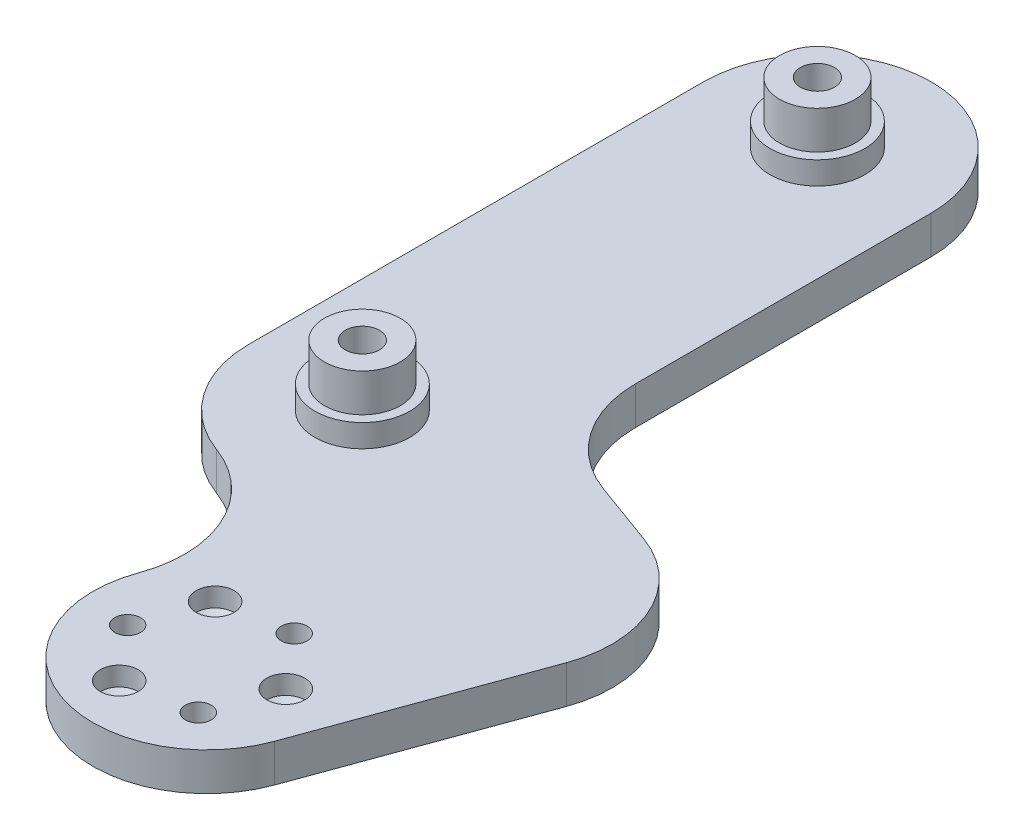
ISO-10303-21;
HEADER;
FILE_DESCRIPTION(('STEP AP214'),'2;1');
FILE_NAME('part.step','',(''),(''),'','','');
FILE_SCHEMA(('AUTOMOTIVE_DESIGN { 1 0 10303 214 1 1 1 1 }'));
ENDSEC;
DATA;
#1=APPLICATION_CONTEXT('core data for automotive mechanical design processes');
#2=APPLICATION_PROTOCOL_DEFINITION('international standard','automotive_design',2000,#1);
#3=PRODUCT_CONTEXT('',#1,'mechanical');
#4=PRODUCT('Part','Part','',(#3));
#5=PRODUCT_RELATED_PRODUCT_CATEGORY('part','',(#4));
#6=PRODUCT_DEFINITION_FORMATION('','',#4);
#7=PRODUCT_DEFINITION_CONTEXT('part definition',#1,'design');
#8=PRODUCT_DEFINITION('design','',#6,#7);
#9=PRODUCT_DEFINITION_SHAPE('','',#8);
#10=(LENGTH_UNIT() NAMED_UNIT(*) SI_UNIT(.MILLI.,.METRE.));
#11=(NAMED_UNIT(*) PLANE_ANGLE_UNIT() SI_UNIT($,.RADIAN.));
#12=(NAMED_UNIT(*) SI_UNIT($,.STERADIAN.) SOLID_ANGLE_UNIT());
#13=UNCERTAINTY_MEASURE_WITH_UNIT(LENGTH_MEASURE(1.E-05),#10,'distance_accuracy_value','');
#14=(GEOMETRIC_REPRESENTATION_CONTEXT(3) GLOBAL_UNCERTAINTY_ASSIGNED_CONTEXT((#13)) GLOBAL_UNIT_ASSIGNED_CONTEXT((#10,
#11,#12)) REPRESENTATION_CONTEXT('',''));
#15=CARTESIAN_POINT('',(0.,0.,0.));
#16=DIRECTION('',(0.,0.,1.));
#17=DIRECTION('',(1.,0.,0.));
#18=AXIS2_PLACEMENT_3D('',#15,#16,#17);
#19=CARTESIAN_POINT('',(0.,5.,0.));
#20=DIRECTION('',(0.,-1.,0.));
#21=DIRECTION('',(0.,0.,-1.));
#22=AXIS2_PLACEMENT_3D('',#19,#20,#21);
#23=CYLINDRICAL_SURFACE('',#22,15.);
#24=DIRECTION('',(0.,-1.,0.));
#25=VECTOR('',#24,1.);
#26=CARTESIAN_POINT('',(-5.13030214988509,5.,14.0953893117886));
#27=LINE('',#26,#25);
#28=CARTESIAN_POINT('',(-5.13030214988509,5.,14.0953893117886));
#29=VERTEX_POINT('',#28);
#30=CARTESIAN_POINT('',(-5.13030214988509,0.,14.0953893117886));
#31=VERTEX_POINT('',#30);
#32=EDGE_CURVE('E220',#29,#31,#27,.T.);
#33=ORIENTED_EDGE('',*,*,#32,.F.);
#34=CARTESIAN_POINT('',(0.,5.,0.));
#35=DIRECTION('',(0.,1.,0.));
#36=DIRECTION('',(0.,0.,1.));
#37=AXIS2_PLACEMENT_3D('',#34,#35,#36);
#38=CIRCLE('',#37,15.);
#39=CARTESIAN_POINT('',(-15.,5.,0.));
#40=VERTEX_POINT('',#39);
#41=EDGE_CURVE('E272',#40,#29,#38,.T.);
#42=ORIENTED_EDGE('',*,*,#41,.F.);
#43=DIRECTION('',(0.,-1.,0.));
#44=VECTOR('',#43,1.);
#45=CARTESIAN_POINT('',(-15.,5.,0.));
#46=LINE('',#45,#44);
#47=CARTESIAN_POINT('',(-15.,0.,0.));
#48=VERTEX_POINT('',#47);
#49=EDGE_CURVE('E275',#40,#48,#46,.T.);
#50=ORIENTED_EDGE('',*,*,#49,.T.);
#51=CARTESIAN_POINT('',(0.,0.,0.));
#52=DIRECTION('',(0.,1.,0.));
#53=DIRECTION('',(0.,0.,1.));
#54=AXIS2_PLACEMENT_3D('',#51,#52,#53);
#55=CIRCLE('',#54,15.);
#56=EDGE_CURVE('E267',#48,#31,#55,.T.);
#57=ORIENTED_EDGE('',*,*,#56,.T.);
#58=EDGE_LOOP('',(#33,#42,#50,#57));
#59=FACE_BOUND('',#58,.T.);
#60=ADVANCED_FACE('F37',(#59),#23,.T.);
#61=CARTESIAN_POINT('',(15.,5.,0.));
#62=DIRECTION('',(-1.,0.,0.));
#63=DIRECTION('',(0.,0.,1.));
#64=AXIS2_PLACEMENT_3D('',#61,#62,#63);
#65=PLANE('',#64);
#66=DIRECTION('',(0.,0.,-1.));
#67=VECTOR('',#66,1.);
#68=CARTESIAN_POINT('',(15.,5.,0.));
#69=LINE('',#68,#67);
#70=CARTESIAN_POINT('',(15.,5.,-21.0062261462912));
#71=VERTEX_POINT('',#70);
#72=CARTESIAN_POINT('',(15.,5.,-60.));
#73=VERTEX_POINT('',#72);
#74=EDGE_CURVE('E264',#71,#73,#69,.T.);
#75=ORIENTED_EDGE('',*,*,#74,.F.);
#76=DIRECTION('',(0.,-1.,0.));
#77=VECTOR('',#76,1.);
#78=CARTESIAN_POINT('',(15.,5.,-21.0062261462912));
#79=LINE('',#78,#77);
#80=CARTESIAN_POINT('',(15.,0.,-21.0062261462912));
#81=VERTEX_POINT('',#80);
#82=EDGE_CURVE('E244',#71,#81,#79,.T.);
#83=ORIENTED_EDGE('',*,*,#82,.T.);
#84=DIRECTION('',(0.,0.,-1.));
#85=VECTOR('',#84,1.);
#86=CARTESIAN_POINT('',(15.,0.,0.));
#87=LINE('',#86,#85);
#88=CARTESIAN_POINT('',(15.,0.,-60.));
#89=VERTEX_POINT('',#88);
#90=EDGE_CURVE('E261',#81,#89,#87,.T.);
#91=ORIENTED_EDGE('',*,*,#90,.T.);
#92=DIRECTION('',(0.,-1.,0.));
#93=VECTOR('',#92,1.);
#94=CARTESIAN_POINT('',(15.,5.,-60.));
#95=LINE('',#94,#93);
#96=EDGE_CURVE('E251',#73,#89,#95,.T.);
#97=ORIENTED_EDGE('',*,*,#96,.F.);
#98=EDGE_LOOP('',(#75,#83,#91,#97));
#99=FACE_BOUND('',#98,.T.);
#100=ADVANCED_FACE('F332',(#99),#65,.F.);
#101=CARTESIAN_POINT('',(0.,5.,-60.));
#102=DIRECTION('',(0.,-1.,0.));
#103=DIRECTION('',(0.,0.,-1.));
#104=AXIS2_PLACEMENT_3D('',#101,#102,#103);
#105=CYLINDRICAL_SURFACE('',#104,15.);
#106=CARTESIAN_POINT('',(0.,0.,-60.));
#107=DIRECTION('',(0.,1.,0.));
#108=DIRECTION('',(0.,0.,1.));
#109=AXIS2_PLACEMENT_3D('',#106,#107,#108);
#110=CIRCLE('',#109,15.);
#111=CARTESIAN_POINT('',(-15.,0.,-60.));
#112=VERTEX_POINT('',#111);
#113=EDGE_CURVE('E277',#89,#112,#110,.T.);
#114=ORIENTED_EDGE('',*,*,#113,.T.);
#115=DIRECTION('',(0.,-1.,0.));
#116=VECTOR('',#115,1.);
#117=CARTESIAN_POINT('',(-15.,5.,-60.));
#118=LINE('',#117,#116);
#119=CARTESIAN_POINT('',(-15.,5.,-60.));
#120=VERTEX_POINT('',#119);
#121=EDGE_CURVE('E286',#120,#112,#118,.T.);
#122=ORIENTED_EDGE('',*,*,#121,.F.);
#123=CARTESIAN_POINT('',(0.,5.,-60.));
#124=DIRECTION('',(0.,1.,0.));
#125=DIRECTION('',(0.,0.,1.));
#126=AXIS2_PLACEMENT_3D('',#123,#124,#125);
#127=CIRCLE('',#126,15.);
#128=EDGE_CURVE('E266',#73,#120,#127,.T.);
#129=ORIENTED_EDGE('',*,*,#128,.F.);
#130=ORIENTED_EDGE('',*,*,#96,.T.);
#131=EDGE_LOOP('',(#114,#122,#129,#130));
#132=FACE_BOUND('',#131,.T.);
#133=ADVANCED_FACE('F338',(#132),#105,.T.);
#134=CARTESIAN_POINT('',(-15.,5.,0.));
#135=DIRECTION('',(-1.,0.,0.));
#136=DIRECTION('',(0.,0.,1.));
#137=AXIS2_PLACEMENT_3D('',#134,#135,#136);
#138=PLANE('',#137);
#139=DIRECTION('',(0.,0.,-1.));
#140=VECTOR('',#139,1.);
#141=CARTESIAN_POINT('',(-15.,0.,0.));
#142=LINE('',#141,#140);
#143=EDGE_CURVE('E280',#48,#112,#142,.T.);
#144=ORIENTED_EDGE('',*,*,#143,.F.);
#145=ORIENTED_EDGE('',*,*,#49,.F.);
#146=DIRECTION('',(0.,0.,-1.));
#147=VECTOR('',#146,1.);
#148=CARTESIAN_POINT('',(-15.,5.,0.));
#149=LINE('',#148,#147);
#150=EDGE_CURVE('E269',#40,#120,#149,.T.);
#151=ORIENTED_EDGE('',*,*,#150,.T.);
#152=ORIENTED_EDGE('',*,*,#121,.T.);
#153=EDGE_LOOP('',(#144,#145,#151,#152));
#154=FACE_BOUND('',#153,.T.);
#155=ADVANCED_FACE('F340',(#154),#138,.T.);
#156=CARTESIAN_POINT('',(0.,5.,-60.));
#157=DIRECTION('',(0.,1.,0.));
#158=DIRECTION('',(0.,0.,1.));
#159=AXIS2_PLACEMENT_3D('',#156,#157,#158);
#160=PLANE('',#159);
#161=CARTESIAN_POINT('',(12.1450858366282,5.,31.5569829352767));
#162=DIRECTION('',(0.,1.,0.));
#163=DIRECTION('',(0.,0.,1.));
#164=AXIS2_PLACEMENT_3D('',#161,#162,#163);
#165=CIRCLE('',#164,2.49999999999999);
#166=CARTESIAN_POINT('',(12.1450858366282,5.,34.0569829352767));
#167=VERTEX_POINT('',#166);
#168=EDGE_CURVE('E131',#167,#167,#165,.T.);
#169=ORIENTED_EDGE('',*,*,#168,.F.);
#170=EDGE_LOOP('',(#169));
#171=FACE_BOUND('',#170,.T.);
#172=CARTESIAN_POINT('',(26.793444100917,5.,36.888549324345));
#173=DIRECTION('',(0.,1.,0.));
#174=DIRECTION('',(0.,0.,1.));
#175=AXIS2_PLACEMENT_3D('',#172,#173,#174);
#176=CIRCLE('',#175,2.49999999999999);
#177=CARTESIAN_POINT('',(26.793444100917,5.,39.388549324345));
#178=VERTEX_POINT('',#177);
#179=EDGE_CURVE('E130',#178,#178,#176,.T.);
#180=ORIENTED_EDGE('',*,*,#179,.F.);
#181=EDGE_LOOP('',(#180));
#182=FACE_BOUND('',#181,.T.);
#183=CARTESIAN_POINT('',(14.8519930338761,5.,46.9086165104206));
#184=DIRECTION('',(0.,1.,0.));
#185=DIRECTION('',(0.,0.,1.));
#186=AXIS2_PLACEMENT_3D('',#183,#184,#185);
#187=CIRCLE('',#186,2.49999999999999);
#188=CARTESIAN_POINT('',(14.8519930338761,5.,49.4086165104206));
#189=VERTEX_POINT('',#188);
#190=EDGE_CURVE('E141',#189,#189,#187,.T.);
#191=ORIENTED_EDGE('',*,*,#190,.F.);
#192=EDGE_LOOP('',(#191));
#193=FACE_BOUND('',#192,.T.);
#194=CARTESIAN_POINT('',(9.06690454669722,5.,40.0142165223497));
#195=DIRECTION('',(0.,1.,0.));
#196=DIRECTION('',(0.,0.,1.));
#197=AXIS2_PLACEMENT_3D('',#194,#195,#196);
#198=CIRCLE('',#197,1.7);
#199=CARTESIAN_POINT('',(9.06690454669722,5.,41.7142165223497));
#200=VERTEX_POINT('',#199);
#201=EDGE_CURVE('E156',#200,#200,#198,.T.);
#202=ORIENTED_EDGE('',*,*,#201,.F.);
#203=EDGE_LOOP('',(#202));
#204=FACE_BOUND('',#203,.T.);
#205=CARTESIAN_POINT('',(23.7152628109859,5.,45.3457829114183));
#206=DIRECTION('',(0.,1.,0.));
#207=DIRECTION('',(0.,0.,1.));
#208=AXIS2_PLACEMENT_3D('',#205,#206,#207);
#209=CIRCLE('',#208,1.7);
#210=CARTESIAN_POINT('',(23.7152628109859,5.,47.0457829114183));
#211=VERTEX_POINT('',#210);
#212=EDGE_CURVE('E166',#211,#211,#209,.T.);
#213=ORIENTED_EDGE('',*,*,#212,.F.);
#214=EDGE_LOOP('',(#213));
#215=FACE_BOUND('',#214,.T.);
#216=CARTESIAN_POINT('',(21.0083556137381,5.,29.9941493362742));
#217=DIRECTION('',(0.,1.,0.));
#218=DIRECTION('',(0.,0.,1.));
#219=AXIS2_PLACEMENT_3D('',#216,#217,#218);
#220=CIRCLE('',#219,1.7);
#221=CARTESIAN_POINT('',(21.0083556137381,5.,31.6941493362743));
#222=VERTEX_POINT('',#221);
#223=EDGE_CURVE('E176',#222,#222,#220,.T.);
#224=ORIENTED_EDGE('',*,*,#223,.F.);
#225=EDGE_LOOP('',(#224));
#226=FACE_BOUND('',#225,.T.);
#227=CARTESIAN_POINT('',(28.1907786235772,5.,10.2606042997702));
#228=DIRECTION('',(0.,-1.,0.));
#229=DIRECTION('',(0.,0.,-1.));
#230=AXIS2_PLACEMENT_3D('',#227,#228,#229);
#231=CIRCLE('',#230,15.);
#232=CARTESIAN_POINT('',(33.3210807734623,5.,-3.83478501201842));
#233=VERTEX_POINT('',#232);
#234=CARTESIAN_POINT('',(42.2861679353658,5.,15.3909064496552));
#235=VERTEX_POINT('',#234);
#236=EDGE_CURVE('E212',#233,#235,#231,.T.);
#237=ORIENTED_EDGE('',*,*,#236,.F.);
#238=DIRECTION('',(0.939692620785907,0.,0.342020143325673));
#239=VECTOR('',#238,1.);
#240=CARTESIAN_POINT('',(15.,5.,-10.5031130731456));
#241=LINE('',#240,#239);
#242=CARTESIAN_POINT('',(24.8696978501149,5.,-6.9108368345026));
#243=VERTEX_POINT('',#242);
#244=EDGE_CURVE('E210',#243,#233,#241,.T.);
#245=ORIENTED_EDGE('',*,*,#244,.F.);
#246=CARTESIAN_POINT('',(30.,5.,-21.0062261462912));
#247=DIRECTION('',(0.,1.,0.));
#248=DIRECTION('',(0.,0.,1.));
#249=AXIS2_PLACEMENT_3D('',#246,#247,#248);
#250=CIRCLE('',#249,15.);
#251=EDGE_CURVE('E300',#243,#71,#250,.F.);
#252=ORIENTED_EDGE('',*,*,#251,.T.);
#253=ORIENTED_EDGE('',*,*,#74,.T.);
#254=ORIENTED_EDGE('',*,*,#128,.T.);
#255=ORIENTED_EDGE('',*,*,#150,.F.);
#256=ORIENTED_EDGE('',*,*,#41,.T.);
#257=CARTESIAN_POINT('',(-10.2606042997701,5.,28.1907786235772));
#258=DIRECTION('',(0.,1.,0.));
#259=DIRECTION('',(0.,0.,1.));
#260=AXIS2_PLACEMENT_3D('',#257,#258,#259);
#261=CIRCLE('',#260,15.);
#262=CARTESIAN_POINT('',(3.83478501201849,5.,33.3210807734624));
#263=VERTEX_POINT('',#262);
#264=EDGE_CURVE('E11',#29,#263,#261,.F.);
#265=ORIENTED_EDGE('',*,*,#264,.T.);
#266=CARTESIAN_POINT('',(17.9301743238071,5.,38.4513829233474));
#267=DIRECTION('',(0.,-1.,0.));
#268=DIRECTION('',(0.,0.,-1.));
#269=AXIS2_PLACEMENT_3D('',#266,#267,#268);
#270=CIRCLE('',#269,15.);
#271=CARTESIAN_POINT('',(32.0255636355957,5.,43.5816850732325));
#272=VERTEX_POINT('',#271);
#273=EDGE_CURVE('E193',#272,#263,#270,.T.);
#274=ORIENTED_EDGE('',*,*,#273,.F.);
#275=DIRECTION('',(-0.34202014332567,0.,0.939692620785908));
#276=VECTOR('',#275,1.);
#277=CARTESIAN_POINT('',(42.2861679353658,5.,15.3909064496552));
#278=LINE('',#277,#276);
#279=EDGE_CURVE('E190',#235,#272,#278,.T.);
#280=ORIENTED_EDGE('',*,*,#279,.F.);
#281=EDGE_LOOP('',(#237,#245,#252,#253,#254,#255,#256,#265,#274,#280));
#282=FACE_BOUND('',#281,.T.);
#283=CARTESIAN_POINT('',(0.,5.,0.));
#284=DIRECTION('',(0.,1.,0.));
#285=DIRECTION('',(0.,0.,1.));
#286=AXIS2_PLACEMENT_3D('',#283,#284,#285);
#287=CIRCLE('',#286,6.25000000000001);
#288=CARTESIAN_POINT('',(0.,5.,6.25000000000001));
#289=VERTEX_POINT('',#288);
#290=EDGE_CURVE('E248',#289,#289,#287,.T.);
#291=ORIENTED_EDGE('',*,*,#290,.F.);
#292=EDGE_LOOP('',(#291));
#293=FACE_BOUND('',#292,.T.);
#294=CARTESIAN_POINT('',(0.,5.,-60.));
#295=DIRECTION('',(0.,1.,0.));
#296=DIRECTION('',(0.,0.,1.));
#297=AXIS2_PLACEMENT_3D('',#294,#295,#296);
#298=CIRCLE('',#297,6.25000000000001);
#299=CARTESIAN_POINT('',(0.,5.,-53.75));
#300=VERTEX_POINT('',#299);
#301=EDGE_CURVE('E255',#300,#300,#298,.T.);
#302=ORIENTED_EDGE('',*,*,#301,.F.);
#303=EDGE_LOOP('',(#302));
#304=FACE_BOUND('',#303,.T.);
#305=ADVANCED_FACE('F313',(#171,#182,#193,#204,#215,#226,#282,#293,#304),#160,.T.);
#306=CARTESIAN_POINT('',(0.,0.,-60.));
#307=DIRECTION('',(0.,1.,0.));
#308=DIRECTION('',(0.,0.,1.));
#309=AXIS2_PLACEMENT_3D('',#306,#307,#308);
#310=PLANE('',#309);
#311=CARTESIAN_POINT('',(9.06690454669722,0.,40.0142165223497));
#312=DIRECTION('',(0.,-1.,0.));
#313=DIRECTION('',(0.,0.,-1.));
#314=AXIS2_PLACEMENT_3D('',#311,#312,#313);
#315=CIRCLE('',#314,3.25);
#316=CARTESIAN_POINT('',(9.06690454669722,0.,36.7642165223497));
#317=VERTEX_POINT('',#316);
#318=EDGE_CURVE('E147',#317,#317,#315,.T.);
#319=ORIENTED_EDGE('',*,*,#318,.F.);
#320=EDGE_LOOP('',(#319));
#321=FACE_BOUND('',#320,.T.);
#322=CARTESIAN_POINT('',(23.7152628109859,0.,45.3457829114183));
#323=DIRECTION('',(0.,-1.,0.));
#324=DIRECTION('',(0.,0.,-1.));
#325=AXIS2_PLACEMENT_3D('',#322,#323,#324);
#326=CIRCLE('',#325,3.25);
#327=CARTESIAN_POINT('',(23.7152628109859,0.,42.0957829114183));
#328=VERTEX_POINT('',#327);
#329=EDGE_CURVE('E157',#328,#328,#326,.T.);
#330=ORIENTED_EDGE('',*,*,#329,.F.);
#331=EDGE_LOOP('',(#330));
#332=FACE_BOUND('',#331,.T.);
#333=CARTESIAN_POINT('',(21.0083556137381,0.,29.9941493362742));
#334=DIRECTION('',(0.,-1.,0.));
#335=DIRECTION('',(0.,0.,-1.));
#336=AXIS2_PLACEMENT_3D('',#333,#334,#335);
#337=CIRCLE('',#336,3.25);
#338=CARTESIAN_POINT('',(21.0083556137381,0.,26.7441493362743));
#339=VERTEX_POINT('',#338);
#340=EDGE_CURVE('E167',#339,#339,#337,.T.);
#341=ORIENTED_EDGE('',*,*,#340,.F.);
#342=EDGE_LOOP('',(#341));
#343=FACE_BOUND('',#342,.T.);
#344=CARTESIAN_POINT('',(0.,0.,0.));
#345=DIRECTION('',(0.,-1.,0.));
#346=DIRECTION('',(0.,0.,-1.));
#347=AXIS2_PLACEMENT_3D('',#344,#345,#346);
#348=CIRCLE('',#347,3.99999999999999);
#349=CARTESIAN_POINT('',(0.,0.,-3.99999999999999));
#350=VERTEX_POINT('',#349);
#351=EDGE_CURVE('E177',#350,#350,#348,.T.);
#352=ORIENTED_EDGE('',*,*,#351,.F.);
#353=EDGE_LOOP('',(#352));
#354=FACE_BOUND('',#353,.T.);
#355=CARTESIAN_POINT('',(0.,0.,-60.));
#356=DIRECTION('',(0.,-1.,0.));
#357=DIRECTION('',(0.,0.,-1.));
#358=AXIS2_PLACEMENT_3D('',#355,#356,#357);
#359=CIRCLE('',#358,4.);
#360=CARTESIAN_POINT('',(0.,0.,-64.));
#361=VERTEX_POINT('',#360);
#362=EDGE_CURVE('E223',#361,#361,#359,.T.);
#363=ORIENTED_EDGE('',*,*,#362,.F.);
#364=EDGE_LOOP('',(#363));
#365=FACE_BOUND('',#364,.T.);
#366=ORIENTED_EDGE('',*,*,#90,.F.);
#367=CARTESIAN_POINT('',(30.,0.,-21.0062261462912));
#368=DIRECTION('',(0.,1.,0.));
#369=DIRECTION('',(0.,0.,1.));
#370=AXIS2_PLACEMENT_3D('',#367,#368,#369);
#371=CIRCLE('',#370,15.);
#372=CARTESIAN_POINT('',(24.8696978501149,0.,-6.9108368345026));
#373=VERTEX_POINT('',#372);
#374=EDGE_CURVE('E60',#81,#373,#371,.T.);
#375=ORIENTED_EDGE('',*,*,#374,.T.);
#376=DIRECTION('',(0.939692620785907,0.,0.342020143325673));
#377=VECTOR('',#376,1.);
#378=CARTESIAN_POINT('',(15.,0.,-10.5031130731456));
#379=LINE('',#378,#377);
#380=CARTESIAN_POINT('',(33.3210807734623,0.,-3.83478501201842));
#381=VERTEX_POINT('',#380);
#382=EDGE_CURVE('E205',#373,#381,#379,.T.);
#383=ORIENTED_EDGE('',*,*,#382,.T.);
#384=CARTESIAN_POINT('',(28.1907786235772,0.,10.2606042997702));
#385=DIRECTION('',(0.,-1.,0.));
#386=DIRECTION('',(0.,0.,-1.));
#387=AXIS2_PLACEMENT_3D('',#384,#385,#386);
#388=CIRCLE('',#387,15.);
#389=CARTESIAN_POINT('',(42.2861679353658,0.,15.3909064496552));
#390=VERTEX_POINT('',#389);
#391=EDGE_CURVE('E213',#381,#390,#388,.T.);
#392=ORIENTED_EDGE('',*,*,#391,.T.);
#393=DIRECTION('',(-0.34202014332567,0.,0.939692620785908));
#394=VECTOR('',#393,1.);
#395=CARTESIAN_POINT('',(42.2861679353658,0.,15.3909064496552));
#396=LINE('',#395,#394);
#397=CARTESIAN_POINT('',(32.0255636355957,0.,43.5816850732325));
#398=VERTEX_POINT('',#397);
#399=EDGE_CURVE('E189',#390,#398,#396,.T.);
#400=ORIENTED_EDGE('',*,*,#399,.T.);
#401=CARTESIAN_POINT('',(17.9301743238071,0.,38.4513829233474));
#402=DIRECTION('',(0.,-1.,0.));
#403=DIRECTION('',(0.,0.,-1.));
#404=AXIS2_PLACEMENT_3D('',#401,#402,#403);
#405=CIRCLE('',#404,15.);
#406=CARTESIAN_POINT('',(3.83478501201849,0.,33.3210807734624));
#407=VERTEX_POINT('',#406);
#408=EDGE_CURVE('E194',#398,#407,#405,.T.);
#409=ORIENTED_EDGE('',*,*,#408,.T.);
#410=CARTESIAN_POINT('',(-10.2606042997701,0.,28.1907786235772));
#411=DIRECTION('',(0.,1.,0.));
#412=DIRECTION('',(0.,0.,1.));
#413=AXIS2_PLACEMENT_3D('',#410,#411,#412);
#414=CIRCLE('',#413,15.);
#415=EDGE_CURVE('E45',#407,#31,#414,.T.);
#416=ORIENTED_EDGE('',*,*,#415,.T.);
#417=ORIENTED_EDGE('',*,*,#56,.F.);
#418=ORIENTED_EDGE('',*,*,#143,.T.);
#419=ORIENTED_EDGE('',*,*,#113,.F.);
#420=EDGE_LOOP('',(#366,#375,#383,#392,#400,#409,#416,#417,#418,#419));
#421=FACE_BOUND('',#420,.T.);
#422=ADVANCED_FACE('F302',(#321,#332,#343,#354,#365,#421),#310,.F.);
#423=CARTESIAN_POINT('',(0.,8.,-60.));
#424=DIRECTION('',(0.,-1.,0.));
#425=DIRECTION('',(0.,0.,-1.));
#426=AXIS2_PLACEMENT_3D('',#423,#424,#425);
#427=CYLINDRICAL_SURFACE('',#426,6.25000000000001);
#428=CARTESIAN_POINT('',(0.,8.,-60.));
#429=DIRECTION('',(0.,1.,0.));
#430=DIRECTION('',(0.,0.,1.));
#431=AXIS2_PLACEMENT_3D('',#428,#429,#430);
#432=CIRCLE('',#431,6.25000000000001);
#433=CARTESIAN_POINT('',(0.,8.,-53.75));
#434=VERTEX_POINT('',#433);
#435=EDGE_CURVE('E258',#434,#434,#432,.T.);
#436=ORIENTED_EDGE('',*,*,#435,.F.);
#437=EDGE_LOOP('',(#436));
#438=FACE_BOUND('',#437,.T.);
#439=ORIENTED_EDGE('',*,*,#301,.T.);
#440=EDGE_LOOP('',(#439));
#441=FACE_BOUND('',#440,.T.);
#442=ADVANCED_FACE('F358',(#438,#441),#427,.T.);
#443=CARTESIAN_POINT('',(0.,8.,-60.));
#444=DIRECTION('',(0.,1.,0.));
#445=DIRECTION('',(0.,0.,1.));
#446=AXIS2_PLACEMENT_3D('',#443,#444,#445);
#447=PLANE('',#446);
#448=CARTESIAN_POINT('',(0.,8.,-60.));
#449=DIRECTION('',(0.,1.,0.));
#450=DIRECTION('',(0.,0.,1.));
#451=AXIS2_PLACEMENT_3D('',#448,#449,#450);
#452=CIRCLE('',#451,5.00000000000001);
#453=CARTESIAN_POINT('',(0.,8.,-55.));
#454=VERTEX_POINT('',#453);
#455=EDGE_CURVE('E245',#454,#454,#452,.T.);
#456=ORIENTED_EDGE('',*,*,#455,.F.);
#457=EDGE_LOOP('',(#456));
#458=FACE_BOUND('',#457,.T.);
#459=ORIENTED_EDGE('',*,*,#435,.T.);
#460=EDGE_LOOP('',(#459));
#461=FACE_BOUND('',#460,.T.);
#462=ADVANCED_FACE('F363',(#458,#461),#447,.T.);
#463=CARTESIAN_POINT('',(0.,8.,0.));
#464=DIRECTION('',(0.,-1.,0.));
#465=DIRECTION('',(0.,0.,-1.));
#466=AXIS2_PLACEMENT_3D('',#463,#464,#465);
#467=CYLINDRICAL_SURFACE('',#466,6.25000000000001);
#468=CARTESIAN_POINT('',(0.,8.,0.));
#469=DIRECTION('',(0.,1.,0.));
#470=DIRECTION('',(0.,0.,1.));
#471=AXIS2_PLACEMENT_3D('',#468,#469,#470);
#472=CIRCLE('',#471,6.25000000000001);
#473=CARTESIAN_POINT('',(0.,8.,6.25000000000001));
#474=VERTEX_POINT('',#473);
#475=EDGE_CURVE('E252',#474,#474,#472,.T.);
#476=ORIENTED_EDGE('',*,*,#475,.F.);
#477=EDGE_LOOP('',(#476));
#478=FACE_BOUND('',#477,.T.);
#479=ORIENTED_EDGE('',*,*,#290,.T.);
#480=EDGE_LOOP('',(#479));
#481=FACE_BOUND('',#480,.T.);
#482=ADVANCED_FACE('F367',(#478,#481),#467,.T.);
#483=CARTESIAN_POINT('',(0.,8.,0.));
#484=DIRECTION('',(0.,1.,0.));
#485=DIRECTION('',(0.,0.,1.));
#486=AXIS2_PLACEMENT_3D('',#483,#484,#485);
#487=PLANE('',#486);
#488=CARTESIAN_POINT('',(0.,8.,0.));
#489=DIRECTION('',(0.,1.,0.));
#490=DIRECTION('',(0.,0.,1.));
#491=AXIS2_PLACEMENT_3D('',#488,#489,#490);
#492=CIRCLE('',#491,5.00000000000001);
#493=CARTESIAN_POINT('',(0.,8.,5.00000000000001));
#494=VERTEX_POINT('',#493);
#495=EDGE_CURVE('E241',#494,#494,#492,.T.);
#496=ORIENTED_EDGE('',*,*,#495,.F.);
#497=EDGE_LOOP('',(#496));
#498=FACE_BOUND('',#497,.T.);
#499=ORIENTED_EDGE('',*,*,#475,.T.);
#500=EDGE_LOOP('',(#499));
#501=FACE_BOUND('',#500,.T.);
#502=ADVANCED_FACE('F371',(#498,#501),#487,.T.);
#503=CARTESIAN_POINT('',(0.,13.,-60.));
#504=DIRECTION('',(0.,-1.,0.));
#505=DIRECTION('',(0.,0.,-1.));
#506=AXIS2_PLACEMENT_3D('',#503,#504,#505);
#507=CYLINDRICAL_SURFACE('',#506,5.00000000000001);
#508=CARTESIAN_POINT('',(0.,13.,-60.));
#509=DIRECTION('',(0.,1.,0.));
#510=DIRECTION('',(0.,0.,1.));
#511=AXIS2_PLACEMENT_3D('',#508,#509,#510);
#512=CIRCLE('',#511,5.00000000000001);
#513=CARTESIAN_POINT('',(0.,13.,-55.));
#514=VERTEX_POINT('',#513);
#515=EDGE_CURVE('E240',#514,#514,#512,.T.);
#516=ORIENTED_EDGE('',*,*,#515,.F.);
#517=EDGE_LOOP('',(#516));
#518=FACE_BOUND('',#517,.T.);
#519=ORIENTED_EDGE('',*,*,#455,.T.);
#520=EDGE_LOOP('',(#519));
#521=FACE_BOUND('',#520,.T.);
#522=ADVANCED_FACE('F375',(#518,#521),#507,.T.);
#523=CARTESIAN_POINT('',(0.,13.,-60.));
#524=DIRECTION('',(0.,1.,0.));
#525=DIRECTION('',(0.,0.,1.));
#526=AXIS2_PLACEMENT_3D('',#523,#524,#525);
#527=PLANE('',#526);
#528=CARTESIAN_POINT('',(0.,13.,-60.));
#529=DIRECTION('',(0.,-1.,0.));
#530=DIRECTION('',(0.,0.,-1.));
#531=AXIS2_PLACEMENT_3D('',#528,#529,#530);
#532=CIRCLE('',#531,2.25);
#533=CARTESIAN_POINT('',(0.,13.,-62.25));
#534=VERTEX_POINT('',#533);
#535=EDGE_CURVE('E234',#534,#534,#532,.T.);
#536=ORIENTED_EDGE('',*,*,#535,.T.);
#537=EDGE_LOOP('',(#536));
#538=FACE_BOUND('',#537,.T.);
#539=ORIENTED_EDGE('',*,*,#515,.T.);
#540=EDGE_LOOP('',(#539));
#541=FACE_BOUND('',#540,.T.);
#542=ADVANCED_FACE('F379',(#538,#541),#527,.T.);
#543=CARTESIAN_POINT('',(0.,13.,0.));
#544=DIRECTION('',(0.,-1.,0.));
#545=DIRECTION('',(0.,0.,-1.));
#546=AXIS2_PLACEMENT_3D('',#543,#544,#545);
#547=CYLINDRICAL_SURFACE('',#546,5.00000000000001);
#548=CARTESIAN_POINT('',(0.,13.,0.));
#549=DIRECTION('',(0.,1.,0.));
#550=DIRECTION('',(0.,0.,1.));
#551=AXIS2_PLACEMENT_3D('',#548,#549,#550);
#552=CIRCLE('',#551,5.00000000000001);
#553=CARTESIAN_POINT('',(0.,13.,5.00000000000001));
#554=VERTEX_POINT('',#553);
#555=EDGE_CURVE('E237',#554,#554,#552,.T.);
#556=ORIENTED_EDGE('',*,*,#555,.F.);
#557=EDGE_LOOP('',(#556));
#558=FACE_BOUND('',#557,.T.);
#559=ORIENTED_EDGE('',*,*,#495,.T.);
#560=EDGE_LOOP('',(#559));
#561=FACE_BOUND('',#560,.T.);
#562=ADVANCED_FACE('F383',(#558,#561),#547,.T.);
#563=CARTESIAN_POINT('',(0.,13.,0.));
#564=DIRECTION('',(0.,1.,0.));
#565=DIRECTION('',(0.,0.,1.));
#566=AXIS2_PLACEMENT_3D('',#563,#564,#565);
#567=PLANE('',#566);
#568=CARTESIAN_POINT('',(0.,13.,0.));
#569=DIRECTION('',(0.,-1.,0.));
#570=DIRECTION('',(0.,0.,-1.));
#571=AXIS2_PLACEMENT_3D('',#568,#569,#570);
#572=CIRCLE('',#571,2.25);
#573=CARTESIAN_POINT('',(0.,13.,-2.25));
#574=VERTEX_POINT('',#573);
#575=EDGE_CURVE('E186',#574,#574,#572,.T.);
#576=ORIENTED_EDGE('',*,*,#575,.T.);
#577=EDGE_LOOP('',(#576));
#578=FACE_BOUND('',#577,.T.);
#579=ORIENTED_EDGE('',*,*,#555,.T.);
#580=EDGE_LOOP('',(#579));
#581=FACE_BOUND('',#580,.T.);
#582=ADVANCED_FACE('F387',(#578,#581),#567,.T.);
#583=CARTESIAN_POINT('',(0.,0.,-60.));
#584=DIRECTION('',(0.,-1.,0.));
#585=DIRECTION('',(0.,0.,-1.));
#586=AXIS2_PLACEMENT_3D('',#583,#584,#585);
#587=CYLINDRICAL_SURFACE('',#586,2.25);
#588=ORIENTED_EDGE('',*,*,#535,.F.);
#589=EDGE_LOOP('',(#588));
#590=FACE_BOUND('',#589,.T.);
#591=CARTESIAN_POINT('',(0.,4.4,-60.));
#592=DIRECTION('',(0.,-1.,0.));
#593=DIRECTION('',(0.,0.,-1.));
#594=AXIS2_PLACEMENT_3D('',#591,#592,#593);
#595=CIRCLE('',#594,2.25);
#596=CARTESIAN_POINT('',(0.,4.4,-62.25));
#597=VERTEX_POINT('',#596);
#598=EDGE_CURVE('E231',#597,#597,#595,.T.);
#599=ORIENTED_EDGE('',*,*,#598,.T.);
#600=EDGE_LOOP('',(#599));
#601=FACE_BOUND('',#600,.T.);
#602=ADVANCED_FACE('F391',(#590,#601),#587,.F.);
#603=CARTESIAN_POINT('',(2.25,4.4,-60.));
#604=DIRECTION('',(0.,1.,0.));
#605=DIRECTION('',(0.,0.,1.));
#606=AXIS2_PLACEMENT_3D('',#603,#604,#605);
#607=PLANE('',#606);
#608=ORIENTED_EDGE('',*,*,#598,.F.);
#609=EDGE_LOOP('',(#608));
#610=FACE_BOUND('',#609,.T.);
#611=CARTESIAN_POINT('',(0.,4.4,-60.));
#612=DIRECTION('',(0.,-1.,0.));
#613=DIRECTION('',(0.,0.,-1.));
#614=AXIS2_PLACEMENT_3D('',#611,#612,#613);
#615=CIRCLE('',#614,4.);
#616=CARTESIAN_POINT('',(0.,4.4,-64.));
#617=VERTEX_POINT('',#616);
#618=EDGE_CURVE('E228',#617,#617,#615,.T.);
#619=ORIENTED_EDGE('',*,*,#618,.T.);
#620=EDGE_LOOP('',(#619));
#621=FACE_BOUND('',#620,.T.);
#622=ADVANCED_FACE('F395',(#610,#621),#607,.F.);
#623=CARTESIAN_POINT('',(0.,0.,-60.));
#624=DIRECTION('',(0.,-1.,0.));
#625=DIRECTION('',(0.,0.,-1.));
#626=AXIS2_PLACEMENT_3D('',#623,#624,#625);
#627=CYLINDRICAL_SURFACE('',#626,4.);
#628=ORIENTED_EDGE('',*,*,#618,.F.);
#629=EDGE_LOOP('',(#628));
#630=FACE_BOUND('',#629,.T.);
#631=ORIENTED_EDGE('',*,*,#362,.T.);
#632=EDGE_LOOP('',(#631));
#633=FACE_BOUND('',#632,.T.);
#634=ADVANCED_FACE('F399',(#630,#633),#627,.F.);
#635=CARTESIAN_POINT('',(28.1907786235772,5.,10.2606042997702));
#636=DIRECTION('',(0.,-1.,0.));
#637=DIRECTION('',(0.,0.,-1.));
#638=AXIS2_PLACEMENT_3D('',#635,#636,#637);
#639=CYLINDRICAL_SURFACE('',#638,15.);
#640=DIRECTION('',(0.,-1.,0.));
#641=VECTOR('',#640,1.);
#642=CARTESIAN_POINT('',(42.2861679353658,5.,15.3909064496552));
#643=LINE('',#642,#641);
#644=EDGE_CURVE('E197',#235,#390,#643,.T.);
#645=ORIENTED_EDGE('',*,*,#644,.T.);
#646=ORIENTED_EDGE('',*,*,#391,.F.);
#647=DIRECTION('',(0.,-1.,0.));
#648=VECTOR('',#647,1.);
#649=CARTESIAN_POINT('',(33.3210807734623,5.,-3.83478501201842));
#650=LINE('',#649,#648);
#651=EDGE_CURVE('E216',#233,#381,#650,.T.);
#652=ORIENTED_EDGE('',*,*,#651,.F.);
#653=ORIENTED_EDGE('',*,*,#236,.T.);
#654=EDGE_LOOP('',(#645,#646,#652,#653));
#655=FACE_BOUND('',#654,.T.);
#656=ADVANCED_FACE('F323',(#655),#639,.T.);
#657=CARTESIAN_POINT('',(15.,5.,-10.5031130731456));
#658=DIRECTION('',(0.342020143325673,0.,-0.939692620785907));
#659=DIRECTION('',(-0.939692620785907,0.,-0.342020143325673));
#660=AXIS2_PLACEMENT_3D('',#657,#658,#659);
#661=PLANE('',#660);
#662=ORIENTED_EDGE('',*,*,#382,.F.);
#663=DIRECTION('',(0.,-1.,0.));
#664=VECTOR('',#663,1.);
#665=CARTESIAN_POINT('',(24.8696978501149,5.,-6.9108368345026));
#666=LINE('',#665,#664);
#667=EDGE_CURVE('E52',#373,#243,#666,.F.);
#668=ORIENTED_EDGE('',*,*,#667,.T.);
#669=ORIENTED_EDGE('',*,*,#244,.T.);
#670=ORIENTED_EDGE('',*,*,#651,.T.);
#671=EDGE_LOOP('',(#662,#668,#669,#670));
#672=FACE_BOUND('',#671,.T.);
#673=ADVANCED_FACE('F325',(#672),#661,.T.);
#674=CARTESIAN_POINT('',(17.9301743238071,5.,38.4513829233474));
#675=DIRECTION('',(0.,-1.,0.));
#676=DIRECTION('',(0.,0.,-1.));
#677=AXIS2_PLACEMENT_3D('',#674,#675,#676);
#678=CYLINDRICAL_SURFACE('',#677,15.);
#679=ORIENTED_EDGE('',*,*,#408,.F.);
#680=DIRECTION('',(0.,-1.,0.));
#681=VECTOR('',#680,1.);
#682=CARTESIAN_POINT('',(32.0255636355957,5.,43.5816850732325));
#683=LINE('',#682,#681);
#684=EDGE_CURVE('E206',#272,#398,#683,.T.);
#685=ORIENTED_EDGE('',*,*,#684,.F.);
#686=ORIENTED_EDGE('',*,*,#273,.T.);
#687=DIRECTION('',(0.,-1.,0.));
#688=VECTOR('',#687,1.);
#689=CARTESIAN_POINT('',(3.83478501201849,5.,33.3210807734624));
#690=LINE('',#689,#688);
#691=EDGE_CURVE('E202',#263,#407,#690,.T.);
#692=ORIENTED_EDGE('',*,*,#691,.T.);
#693=EDGE_LOOP('',(#679,#685,#686,#692));
#694=FACE_BOUND('',#693,.T.);
#695=ADVANCED_FACE('F318',(#694),#678,.T.);
#696=CARTESIAN_POINT('',(42.2861679353658,5.,15.3909064496552));
#697=DIRECTION('',(0.939692620785908,0.,0.34202014332567));
#698=DIRECTION('',(0.34202014332567,0.,-0.939692620785908));
#699=AXIS2_PLACEMENT_3D('',#696,#697,#698);
#700=PLANE('',#699);
#701=ORIENTED_EDGE('',*,*,#399,.F.);
#702=ORIENTED_EDGE('',*,*,#644,.F.);
#703=ORIENTED_EDGE('',*,*,#279,.T.);
#704=ORIENTED_EDGE('',*,*,#684,.T.);
#705=EDGE_LOOP('',(#701,#702,#703,#704));
#706=FACE_BOUND('',#705,.T.);
#707=ADVANCED_FACE('F320',(#706),#700,.T.);
#708=CARTESIAN_POINT('',(0.,0.,0.));
#709=DIRECTION('',(0.,-1.,0.));
#710=DIRECTION('',(0.,0.,-1.));
#711=AXIS2_PLACEMENT_3D('',#708,#709,#710);
#712=CYLINDRICAL_SURFACE('',#711,2.25);
#713=ORIENTED_EDGE('',*,*,#575,.F.);
#714=EDGE_LOOP('',(#713));
#715=FACE_BOUND('',#714,.T.);
#716=CARTESIAN_POINT('',(0.,4.4,0.));
#717=DIRECTION('',(0.,-1.,0.));
#718=DIRECTION('',(0.,0.,-1.));
#719=AXIS2_PLACEMENT_3D('',#716,#717,#718);
#720=CIRCLE('',#719,2.25000000000001);
#721=CARTESIAN_POINT('',(0.,4.4,-2.25000000000001));
#722=VERTEX_POINT('',#721);
#723=EDGE_CURVE('E183',#722,#722,#720,.T.);
#724=ORIENTED_EDGE('',*,*,#723,.T.);
#725=EDGE_LOOP('',(#724));
#726=FACE_BOUND('',#725,.T.);
#727=ADVANCED_FACE('F410',(#715,#726),#712,.F.);
#728=CARTESIAN_POINT('',(2.25000000000001,4.4,0.));
#729=DIRECTION('',(0.,1.,0.));
#730=DIRECTION('',(0.,0.,1.));
#731=AXIS2_PLACEMENT_3D('',#728,#729,#730);
#732=PLANE('',#731);
#733=ORIENTED_EDGE('',*,*,#723,.F.);
#734=EDGE_LOOP('',(#733));
#735=FACE_BOUND('',#734,.T.);
#736=CARTESIAN_POINT('',(0.,4.4,0.));
#737=DIRECTION('',(0.,-1.,0.));
#738=DIRECTION('',(0.,0.,-1.));
#739=AXIS2_PLACEMENT_3D('',#736,#737,#738);
#740=CIRCLE('',#739,3.99999999999999);
#741=CARTESIAN_POINT('',(0.,4.4,-3.99999999999999));
#742=VERTEX_POINT('',#741);
#743=EDGE_CURVE('E180',#742,#742,#740,.T.);
#744=ORIENTED_EDGE('',*,*,#743,.T.);
#745=EDGE_LOOP('',(#744));
#746=FACE_BOUND('',#745,.T.);
#747=ADVANCED_FACE('F415',(#735,#746),#732,.F.);
#748=CARTESIAN_POINT('',(0.,0.,0.));
#749=DIRECTION('',(0.,-1.,0.));
#750=DIRECTION('',(0.,0.,-1.));
#751=AXIS2_PLACEMENT_3D('',#748,#749,#750);
#752=CYLINDRICAL_SURFACE('',#751,3.99999999999999);
#753=ORIENTED_EDGE('',*,*,#743,.F.);
#754=EDGE_LOOP('',(#753));
#755=FACE_BOUND('',#754,.T.);
#756=ORIENTED_EDGE('',*,*,#351,.T.);
#757=EDGE_LOOP('',(#756));
#758=FACE_BOUND('',#757,.T.);
#759=ADVANCED_FACE('F419',(#755,#758),#752,.F.);
#760=CARTESIAN_POINT('',(21.0083556137381,0.,29.9941493362742));
#761=DIRECTION('',(0.,-1.,0.));
#762=DIRECTION('',(0.,0.,-1.));
#763=AXIS2_PLACEMENT_3D('',#760,#761,#762);
#764=CYLINDRICAL_SURFACE('',#763,1.7);
#765=ORIENTED_EDGE('',*,*,#223,.T.);
#766=EDGE_LOOP('',(#765));
#767=FACE_BOUND('',#766,.T.);
#768=CARTESIAN_POINT('',(21.0083556137381,2.5,29.9941493362742));
#769=DIRECTION('',(0.,-1.,0.));
#770=DIRECTION('',(0.,0.,-1.));
#771=AXIS2_PLACEMENT_3D('',#768,#769,#770);
#772=CIRCLE('',#771,1.7);
#773=CARTESIAN_POINT('',(21.0083556137381,2.5,28.2941493362742));
#774=VERTEX_POINT('',#773);
#775=EDGE_CURVE('E173',#774,#774,#772,.T.);
#776=ORIENTED_EDGE('',*,*,#775,.T.);
#777=EDGE_LOOP('',(#776));
#778=FACE_BOUND('',#777,.T.);
#779=ADVANCED_FACE('F423',(#767,#778),#764,.F.);
#780=CARTESIAN_POINT('',(22.7083556137381,2.5,29.9941493362742));
#781=DIRECTION('',(0.,1.,0.));
#782=DIRECTION('',(0.,0.,1.));
#783=AXIS2_PLACEMENT_3D('',#780,#781,#782);
#784=PLANE('',#783);
#785=ORIENTED_EDGE('',*,*,#775,.F.);
#786=EDGE_LOOP('',(#785));
#787=FACE_BOUND('',#786,.T.);
#788=CARTESIAN_POINT('',(21.0083556137381,2.5,29.9941493362742));
#789=DIRECTION('',(0.,-1.,0.));
#790=DIRECTION('',(0.,0.,-1.));
#791=AXIS2_PLACEMENT_3D('',#788,#789,#790);
#792=CIRCLE('',#791,3.25);
#793=CARTESIAN_POINT('',(21.0083556137381,2.5,26.7441493362743));
#794=VERTEX_POINT('',#793);
#795=EDGE_CURVE('E170',#794,#794,#792,.T.);
#796=ORIENTED_EDGE('',*,*,#795,.T.);
#797=EDGE_LOOP('',(#796));
#798=FACE_BOUND('',#797,.T.);
#799=ADVANCED_FACE('F427',(#787,#798),#784,.F.);
#800=CARTESIAN_POINT('',(21.0083556137381,0.,29.9941493362742));
#801=DIRECTION('',(0.,-1.,0.));
#802=DIRECTION('',(0.,0.,-1.));
#803=AXIS2_PLACEMENT_3D('',#800,#801,#802);
#804=CYLINDRICAL_SURFACE('',#803,3.25);
#805=ORIENTED_EDGE('',*,*,#795,.F.);
#806=EDGE_LOOP('',(#805));
#807=FACE_BOUND('',#806,.T.);
#808=ORIENTED_EDGE('',*,*,#340,.T.);
#809=EDGE_LOOP('',(#808));
#810=FACE_BOUND('',#809,.T.);
#811=ADVANCED_FACE('F431',(#807,#810),#804,.F.);
#812=CARTESIAN_POINT('',(23.7152628109859,0.,45.3457829114183));
#813=DIRECTION('',(0.,-1.,0.));
#814=DIRECTION('',(0.,0.,-1.));
#815=AXIS2_PLACEMENT_3D('',#812,#813,#814);
#816=CYLINDRICAL_SURFACE('',#815,1.7);
#817=ORIENTED_EDGE('',*,*,#212,.T.);
#818=EDGE_LOOP('',(#817));
#819=FACE_BOUND('',#818,.T.);
#820=CARTESIAN_POINT('',(23.7152628109859,2.5,45.3457829114183));
#821=DIRECTION('',(0.,-1.,0.));
#822=DIRECTION('',(0.,0.,-1.));
#823=AXIS2_PLACEMENT_3D('',#820,#821,#822);
#824=CIRCLE('',#823,1.7);
#825=CARTESIAN_POINT('',(23.7152628109859,2.5,43.6457829114183));
#826=VERTEX_POINT('',#825);
#827=EDGE_CURVE('E163',#826,#826,#824,.T.);
#828=ORIENTED_EDGE('',*,*,#827,.T.);
#829=EDGE_LOOP('',(#828));
#830=FACE_BOUND('',#829,.T.);
#831=ADVANCED_FACE('F435',(#819,#830),#816,.F.);
#832=CARTESIAN_POINT('',(25.4152628109859,2.5,45.3457829114183));
#833=DIRECTION('',(0.,1.,0.));
#834=DIRECTION('',(0.,0.,1.));
#835=AXIS2_PLACEMENT_3D('',#832,#833,#834);
#836=PLANE('',#835);
#837=ORIENTED_EDGE('',*,*,#827,.F.);
#838=EDGE_LOOP('',(#837));
#839=FACE_BOUND('',#838,.T.);
#840=CARTESIAN_POINT('',(23.7152628109859,2.5,45.3457829114183));
#841=DIRECTION('',(0.,-1.,0.));
#842=DIRECTION('',(0.,0.,-1.));
#843=AXIS2_PLACEMENT_3D('',#840,#841,#842);
#844=CIRCLE('',#843,3.25);
#845=CARTESIAN_POINT('',(23.7152628109859,2.5,42.0957829114183));
#846=VERTEX_POINT('',#845);
#847=EDGE_CURVE('E160',#846,#846,#844,.T.);
#848=ORIENTED_EDGE('',*,*,#847,.T.);
#849=EDGE_LOOP('',(#848));
#850=FACE_BOUND('',#849,.T.);
#851=ADVANCED_FACE('F439',(#839,#850),#836,.F.);
#852=CARTESIAN_POINT('',(23.7152628109859,0.,45.3457829114183));
#853=DIRECTION('',(0.,-1.,0.));
#854=DIRECTION('',(0.,0.,-1.));
#855=AXIS2_PLACEMENT_3D('',#852,#853,#854);
#856=CYLINDRICAL_SURFACE('',#855,3.25);
#857=ORIENTED_EDGE('',*,*,#847,.F.);
#858=EDGE_LOOP('',(#857));
#859=FACE_BOUND('',#858,.T.);
#860=ORIENTED_EDGE('',*,*,#329,.T.);
#861=EDGE_LOOP('',(#860));
#862=FACE_BOUND('',#861,.T.);
#863=ADVANCED_FACE('F443',(#859,#862),#856,.F.);
#864=CARTESIAN_POINT('',(9.06690454669722,0.,40.0142165223497));
#865=DIRECTION('',(0.,-1.,0.));
#866=DIRECTION('',(0.,0.,-1.));
#867=AXIS2_PLACEMENT_3D('',#864,#865,#866);
#868=CYLINDRICAL_SURFACE('',#867,1.7);
#869=ORIENTED_EDGE('',*,*,#201,.T.);
#870=EDGE_LOOP('',(#869));
#871=FACE_BOUND('',#870,.T.);
#872=CARTESIAN_POINT('',(9.06690454669722,2.5,40.0142165223497));
#873=DIRECTION('',(0.,-1.,0.));
#874=DIRECTION('',(0.,0.,-1.));
#875=AXIS2_PLACEMENT_3D('',#872,#873,#874);
#876=CIRCLE('',#875,1.7);
#877=CARTESIAN_POINT('',(9.06690454669722,2.5,38.3142165223497));
#878=VERTEX_POINT('',#877);
#879=EDGE_CURVE('E153',#878,#878,#876,.T.);
#880=ORIENTED_EDGE('',*,*,#879,.T.);
#881=EDGE_LOOP('',(#880));
#882=FACE_BOUND('',#881,.T.);
#883=ADVANCED_FACE('F447',(#871,#882),#868,.F.);
#884=CARTESIAN_POINT('',(10.7669045466972,2.5,40.0142165223497));
#885=DIRECTION('',(0.,1.,0.));
#886=DIRECTION('',(0.,0.,1.));
#887=AXIS2_PLACEMENT_3D('',#884,#885,#886);
#888=PLANE('',#887);
#889=ORIENTED_EDGE('',*,*,#879,.F.);
#890=EDGE_LOOP('',(#889));
#891=FACE_BOUND('',#890,.T.);
#892=CARTESIAN_POINT('',(9.06690454669722,2.5,40.0142165223497));
#893=DIRECTION('',(0.,-1.,0.));
#894=DIRECTION('',(0.,0.,-1.));
#895=AXIS2_PLACEMENT_3D('',#892,#893,#894);
#896=CIRCLE('',#895,3.25);
#897=CARTESIAN_POINT('',(9.06690454669722,2.5,36.7642165223497));
#898=VERTEX_POINT('',#897);
#899=EDGE_CURVE('E150',#898,#898,#896,.T.);
#900=ORIENTED_EDGE('',*,*,#899,.T.);
#901=EDGE_LOOP('',(#900));
#902=FACE_BOUND('',#901,.T.);
#903=ADVANCED_FACE('F451',(#891,#902),#888,.F.);
#904=CARTESIAN_POINT('',(9.06690454669722,0.,40.0142165223497));
#905=DIRECTION('',(0.,-1.,0.));
#906=DIRECTION('',(0.,0.,-1.));
#907=AXIS2_PLACEMENT_3D('',#904,#905,#906);
#908=CYLINDRICAL_SURFACE('',#907,3.25);
#909=ORIENTED_EDGE('',*,*,#899,.F.);
#910=EDGE_LOOP('',(#909));
#911=FACE_BOUND('',#910,.T.);
#912=ORIENTED_EDGE('',*,*,#318,.T.);
#913=EDGE_LOOP('',(#912));
#914=FACE_BOUND('',#913,.T.);
#915=ADVANCED_FACE('F455',(#911,#914),#908,.F.);
#916=CARTESIAN_POINT('',(14.8519930338761,2.5,46.9086165104206));
#917=DIRECTION('',(0.,1.,0.));
#918=DIRECTION('',(0.,0.,1.));
#919=AXIS2_PLACEMENT_3D('',#916,#917,#918);
#920=CONICAL_SURFACE('',#919,2.5,1.02974425867665);
#921=CARTESIAN_POINT('',(14.8519930338761,0.997848452431099,46.9086165104206));
#922=VERTEX_POINT('',#921);
#923=VERTEX_LOOP('',#922);
#924=FACE_BOUND('',#923,.T.);
#925=CARTESIAN_POINT('',(14.8519930338761,2.5,46.9086165104206));
#926=DIRECTION('',(0.,1.,0.));
#927=DIRECTION('',(0.,0.,1.));
#928=AXIS2_PLACEMENT_3D('',#925,#926,#927);
#929=CIRCLE('',#928,2.5);
#930=CARTESIAN_POINT('',(14.8519930338761,2.5,49.4086165104206));
#931=VERTEX_POINT('',#930);
#932=EDGE_CURVE('E144',#931,#931,#929,.T.);
#933=ORIENTED_EDGE('',*,*,#932,.T.);
#934=EDGE_LOOP('',(#933));
#935=FACE_BOUND('',#934,.T.);
#936=ADVANCED_FACE('F459',(#924,#935),#920,.F.);
#937=CARTESIAN_POINT('',(14.8519930338761,5.,46.9086165104206));
#938=DIRECTION('',(0.,1.,0.));
#939=DIRECTION('',(0.,0.,1.));
#940=AXIS2_PLACEMENT_3D('',#937,#938,#939);
#941=CYLINDRICAL_SURFACE('',#940,2.5);
#942=ORIENTED_EDGE('',*,*,#932,.F.);
#943=EDGE_LOOP('',(#942));
#944=FACE_BOUND('',#943,.T.);
#945=ORIENTED_EDGE('',*,*,#190,.T.);
#946=EDGE_LOOP('',(#945));
#947=FACE_BOUND('',#946,.T.);
#948=ADVANCED_FACE('F463',(#944,#947),#941,.F.);
#949=CARTESIAN_POINT('',(26.793444100917,2.5,36.888549324345));
#950=DIRECTION('',(0.,1.,0.));
#951=DIRECTION('',(0.,0.,1.));
#952=AXIS2_PLACEMENT_3D('',#949,#950,#951);
#953=CONICAL_SURFACE('',#952,2.5,1.02974425867665);
#954=CARTESIAN_POINT('',(26.793444100917,0.997848452431099,36.888549324345));
#955=VERTEX_POINT('',#954);
#956=VERTEX_LOOP('',#955);
#957=FACE_BOUND('',#956,.T.);
#958=CARTESIAN_POINT('',(26.793444100917,2.5,36.888549324345));
#959=DIRECTION('',(0.,1.,0.));
#960=DIRECTION('',(0.,0.,1.));
#961=AXIS2_PLACEMENT_3D('',#958,#959,#960);
#962=CIRCLE('',#961,2.5);
#963=CARTESIAN_POINT('',(26.793444100917,2.5,39.388549324345));
#964=VERTEX_POINT('',#963);
#965=EDGE_CURVE('E134',#964,#964,#962,.T.);
#966=ORIENTED_EDGE('',*,*,#965,.T.);
#967=EDGE_LOOP('',(#966));
#968=FACE_BOUND('',#967,.T.);
#969=ADVANCED_FACE('F467',(#957,#968),#953,.F.);
#970=CARTESIAN_POINT('',(26.793444100917,5.,36.888549324345));
#971=DIRECTION('',(0.,1.,0.));
#972=DIRECTION('',(0.,0.,1.));
#973=AXIS2_PLACEMENT_3D('',#970,#971,#972);
#974=CYLINDRICAL_SURFACE('',#973,2.5);
#975=ORIENTED_EDGE('',*,*,#965,.F.);
#976=EDGE_LOOP('',(#975));
#977=FACE_BOUND('',#976,.T.);
#978=ORIENTED_EDGE('',*,*,#179,.T.);
#979=EDGE_LOOP('',(#978));
#980=FACE_BOUND('',#979,.T.);
#981=ADVANCED_FACE('F124',(#977,#980),#974,.F.);
#982=CARTESIAN_POINT('',(12.1450858366282,2.5,31.5569829352767));
#983=DIRECTION('',(0.,1.,0.));
#984=DIRECTION('',(0.,0.,1.));
#985=AXIS2_PLACEMENT_3D('',#982,#983,#984);
#986=CONICAL_SURFACE('',#985,2.5,1.02974425867665);
#987=CARTESIAN_POINT('',(12.1450858366282,0.997848452431099,31.5569829352767));
#988=VERTEX_POINT('',#987);
#989=VERTEX_LOOP('',#988);
#990=FACE_BOUND('',#989,.T.);
#991=CARTESIAN_POINT('',(12.1450858366282,2.5,31.5569829352767));
#992=DIRECTION('',(0.,1.,0.));
#993=DIRECTION('',(0.,0.,1.));
#994=AXIS2_PLACEMENT_3D('',#991,#992,#993);
#995=CIRCLE('',#994,2.5);
#996=CARTESIAN_POINT('',(12.1450858366282,2.5,34.0569829352767));
#997=VERTEX_POINT('',#996);
#998=EDGE_CURVE('E128',#997,#997,#995,.T.);
#999=ORIENTED_EDGE('',*,*,#998,.T.);
#1000=EDGE_LOOP('',(#999));
#1001=FACE_BOUND('',#1000,.T.);
#1002=ADVANCED_FACE('F120',(#990,#1001),#986,.F.);
#1003=CARTESIAN_POINT('',(12.1450858366282,5.,31.5569829352767));
#1004=DIRECTION('',(0.,1.,0.));
#1005=DIRECTION('',(0.,0.,1.));
#1006=AXIS2_PLACEMENT_3D('',#1003,#1004,#1005);
#1007=CYLINDRICAL_SURFACE('',#1006,2.49999999999999);
#1008=ORIENTED_EDGE('',*,*,#998,.F.);
#1009=EDGE_LOOP('',(#1008));
#1010=FACE_BOUND('',#1009,.T.);
#1011=ORIENTED_EDGE('',*,*,#168,.T.);
#1012=EDGE_LOOP('',(#1011));
#1013=FACE_BOUND('',#1012,.T.);
#1014=ADVANCED_FACE('F123',(#1010,#1013),#1007,.F.);
#1015=CARTESIAN_POINT('',(30.,5.,-21.0062261462912));
#1016=DIRECTION('',(0.,-1.,0.));
#1017=DIRECTION('',(0.,0.,-1.));
#1018=AXIS2_PLACEMENT_3D('',#1015,#1016,#1017);
#1019=CYLINDRICAL_SURFACE('',#1018,15.);
#1020=ORIENTED_EDGE('',*,*,#251,.F.);
#1021=ORIENTED_EDGE('',*,*,#667,.F.);
#1022=ORIENTED_EDGE('',*,*,#374,.F.);
#1023=ORIENTED_EDGE('',*,*,#82,.F.);
#1024=EDGE_LOOP('',(#1020,#1021,#1022,#1023));
#1025=FACE_BOUND('',#1024,.T.);
#1026=ADVANCED_FACE('F330',(#1025),#1019,.F.);
#1027=CARTESIAN_POINT('',(-10.2606042997701,5.,28.1907786235772));
#1028=DIRECTION('',(0.,1.,0.));
#1029=DIRECTION('',(0.,0.,1.));
#1030=AXIS2_PLACEMENT_3D('',#1027,#1028,#1029);
#1031=CYLINDRICAL_SURFACE('',#1030,15.);
#1032=ORIENTED_EDGE('',*,*,#264,.F.);
#1033=ORIENTED_EDGE('',*,*,#32,.T.);
#1034=ORIENTED_EDGE('',*,*,#415,.F.);
#1035=ORIENTED_EDGE('',*,*,#691,.F.);
#1036=EDGE_LOOP('',(#1032,#1033,#1034,#1035));
#1037=FACE_BOUND('',#1036,.T.);
#1038=ADVANCED_FACE('F39',(#1037),#1031,.F.);
#1039=CLOSED_SHELL('',(#60,#100,#133,#155,#305,#422,#442,#462,#482,#502,#522,#542,#562,#582,
#602,#622,#634,#656,#673,#695,#707,#727,#747,#759,#779,#799,#811,#831,#851,#863,#883,#903,#915,
#936,#948,#969,#981,#1002,#1014,#1026,#1038));
#1040=MANIFOLD_SOLID_BREP('B2',#1039);
#1041=ADVANCED_BREP_SHAPE_REPRESENTATION('',(#18,#1040),#14);
#1042=SHAPE_DEFINITION_REPRESENTATION(#9,#1041);
ENDSEC;
END-ISO-10303-21;
